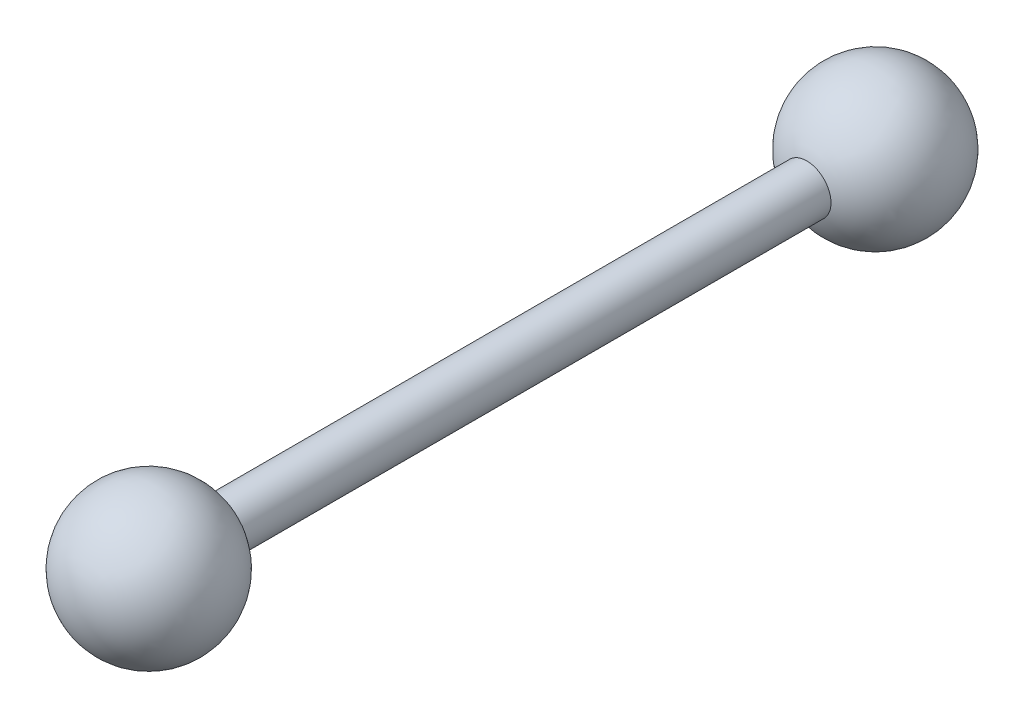
ISO-10303-21;
HEADER;
FILE_DESCRIPTION(('STEP AP214'),'2;1');
FILE_NAME('part.step','',(''),(''),'','','');
FILE_SCHEMA(('AUTOMOTIVE_DESIGN { 1 0 10303 214 1 1 1 1 }'));
ENDSEC;
DATA;
#1=APPLICATION_CONTEXT('core data for automotive mechanical design processes');
#2=APPLICATION_PROTOCOL_DEFINITION('international standard','automotive_design',2000,#1);
#3=PRODUCT_CONTEXT('',#1,'mechanical');
#4=PRODUCT('Part','Part','',(#3));
#5=PRODUCT_RELATED_PRODUCT_CATEGORY('part','',(#4));
#6=PRODUCT_DEFINITION_FORMATION('','',#4);
#7=PRODUCT_DEFINITION_CONTEXT('part definition',#1,'design');
#8=PRODUCT_DEFINITION('design','',#6,#7);
#9=PRODUCT_DEFINITION_SHAPE('','',#8);
#10=(LENGTH_UNIT() NAMED_UNIT(*) SI_UNIT(.MILLI.,.METRE.));
#11=(NAMED_UNIT(*) PLANE_ANGLE_UNIT() SI_UNIT($,.RADIAN.));
#12=(NAMED_UNIT(*) SI_UNIT($,.STERADIAN.) SOLID_ANGLE_UNIT());
#13=UNCERTAINTY_MEASURE_WITH_UNIT(LENGTH_MEASURE(1.E-05),#10,'distance_accuracy_value','');
#14=(GEOMETRIC_REPRESENTATION_CONTEXT(3) GLOBAL_UNCERTAINTY_ASSIGNED_CONTEXT((#13)) GLOBAL_UNIT_ASSIGNED_CONTEXT((#10,
#11,#12)) REPRESENTATION_CONTEXT('',''));
#15=CARTESIAN_POINT('',(0.,0.,0.));
#16=DIRECTION('',(0.,0.,1.));
#17=DIRECTION('',(1.,0.,0.));
#18=AXIS2_PLACEMENT_3D('',#15,#16,#17);
#19=CARTESIAN_POINT('',(0.,0.,-75.));
#20=DIRECTION('',(0.,0.,-1.));
#21=DIRECTION('',(1.,0.,0.));
#22=AXIS2_PLACEMENT_3D('',#19,#20,#21);
#23=SPHERICAL_SURFACE('',#22,15.);
#24=CARTESIAN_POINT('',(0.,0.,-60.857864376269));
#25=DIRECTION('',(0.,0.,-1.));
#26=DIRECTION('',(-1.,0.,0.));
#27=AXIS2_PLACEMENT_3D('',#24,#25,#26);
#28=CIRCLE('',#27,4.99999999999996);
#29=CARTESIAN_POINT('',(-4.99999999999992,0.,-60.857864376269));
#30=VERTEX_POINT('',#29);
#31=EDGE_CURVE('E36',#30,#30,#28,.T.);
#32=ORIENTED_EDGE('',*,*,#31,.T.);
#33=EDGE_LOOP('',(#32));
#34=FACE_BOUND('',#33,.T.);
#35=ADVANCED_FACE('F30',(#34),#23,.T.);
#36=CARTESIAN_POINT('',(0.,0.,75.));
#37=DIRECTION('',(0.,0.,-1.));
#38=DIRECTION('',(1.,0.,0.));
#39=AXIS2_PLACEMENT_3D('',#36,#37,#38);
#40=SPHERICAL_SURFACE('',#39,15.);
#41=CARTESIAN_POINT('',(0.,0.,60.857864376269));
#42=DIRECTION('',(0.,0.,-1.));
#43=DIRECTION('',(-1.,0.,0.));
#44=AXIS2_PLACEMENT_3D('',#41,#42,#43);
#45=CIRCLE('',#44,4.99999999999998);
#46=CARTESIAN_POINT('',(-4.99999999999994,0.,60.857864376269));
#47=VERTEX_POINT('',#46);
#48=EDGE_CURVE('E10',#47,#47,#45,.T.);
#49=ORIENTED_EDGE('',*,*,#48,.F.);
#50=EDGE_LOOP('',(#49));
#51=FACE_BOUND('',#50,.T.);
#52=ADVANCED_FACE('F45',(#51),#40,.T.);
#53=CARTESIAN_POINT('',(0.,0.,-90.));
#54=DIRECTION('',(0.,0.,-1.));
#55=DIRECTION('',(-1.,0.,0.));
#56=AXIS2_PLACEMENT_3D('',#53,#54,#55);
#57=CYLINDRICAL_SURFACE('',#56,4.99999999999997);
#58=ORIENTED_EDGE('',*,*,#31,.F.);
#59=EDGE_LOOP('',(#58));
#60=FACE_BOUND('',#59,.T.);
#61=ORIENTED_EDGE('',*,*,#48,.T.);
#62=EDGE_LOOP('',(#61));
#63=FACE_BOUND('',#62,.T.);
#64=ADVANCED_FACE('F43',(#60,#63),#57,.T.);
#65=CLOSED_SHELL('',(#35,#52,#64));
#66=MANIFOLD_SOLID_BREP('B2',#65);
#67=ADVANCED_BREP_SHAPE_REPRESENTATION('',(#18,#66),#14);
#68=SHAPE_DEFINITION_REPRESENTATION(#9,#67);
ENDSEC;
END-ISO-10303-21;
